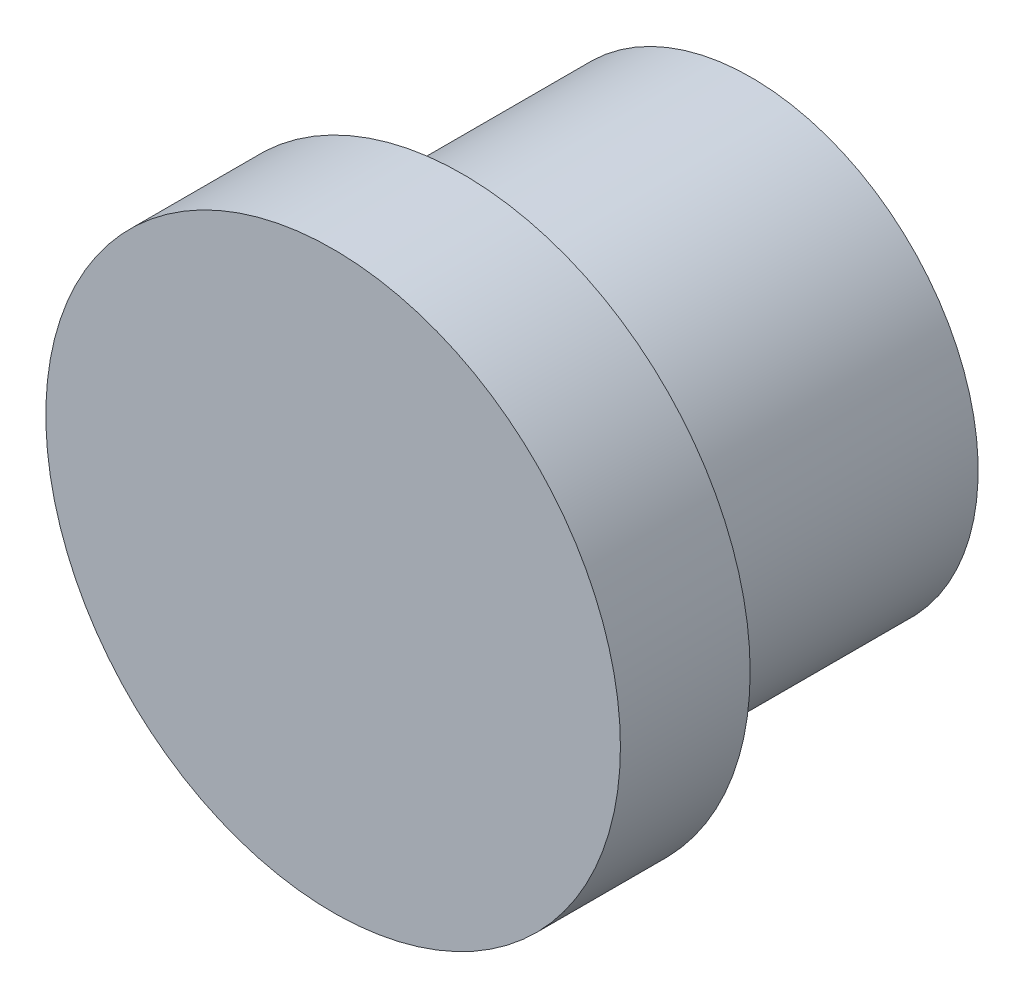
ISO-10303-21;
HEADER;
FILE_DESCRIPTION(('STEP AP214'),'2;1');
FILE_NAME('part.step','',(''),(''),'','','');
FILE_SCHEMA(('AUTOMOTIVE_DESIGN { 1 0 10303 214 1 1 1 1 }'));
ENDSEC;
DATA;
#1=APPLICATION_CONTEXT('core data for automotive mechanical design processes');
#2=APPLICATION_PROTOCOL_DEFINITION('international standard','automotive_design',2000,#1);
#3=PRODUCT_CONTEXT('',#1,'mechanical');
#4=PRODUCT('Part','Part','',(#3));
#5=PRODUCT_RELATED_PRODUCT_CATEGORY('part','',(#4));
#6=PRODUCT_DEFINITION_FORMATION('','',#4);
#7=PRODUCT_DEFINITION_CONTEXT('part definition',#1,'design');
#8=PRODUCT_DEFINITION('design','',#6,#7);
#9=PRODUCT_DEFINITION_SHAPE('','',#8);
#10=(LENGTH_UNIT() NAMED_UNIT(*) SI_UNIT(.MILLI.,.METRE.));
#11=(NAMED_UNIT(*) PLANE_ANGLE_UNIT() SI_UNIT($,.RADIAN.));
#12=(NAMED_UNIT(*) SI_UNIT($,.STERADIAN.) SOLID_ANGLE_UNIT());
#13=UNCERTAINTY_MEASURE_WITH_UNIT(LENGTH_MEASURE(1.E-05),#10,'distance_accuracy_value','');
#14=(GEOMETRIC_REPRESENTATION_CONTEXT(3) GLOBAL_UNCERTAINTY_ASSIGNED_CONTEXT((#13)) GLOBAL_UNIT_ASSIGNED_CONTEXT((#10,
#11,#12)) REPRESENTATION_CONTEXT('',''));
#15=CARTESIAN_POINT('',(0.,0.,0.));
#16=DIRECTION('',(0.,0.,1.));
#17=DIRECTION('',(1.,0.,0.));
#18=AXIS2_PLACEMENT_3D('',#15,#16,#17);
#19=CARTESIAN_POINT('',(0.,0.,4.064));
#20=DIRECTION('',(0.,0.,-1.));
#21=DIRECTION('',(-1.,0.,0.));
#22=AXIS2_PLACEMENT_3D('',#19,#20,#21);
#23=CYLINDRICAL_SURFACE('',#22,9.);
#24=CARTESIAN_POINT('',(0.,0.,4.064));
#25=DIRECTION('',(0.,0.,1.));
#26=DIRECTION('',(1.,0.,0.));
#27=AXIS2_PLACEMENT_3D('',#24,#25,#26);
#28=CIRCLE('',#27,9.);
#29=CARTESIAN_POINT('',(9.,0.,4.064));
#30=VERTEX_POINT('',#29);
#31=EDGE_CURVE('E38',#30,#30,#28,.T.);
#32=ORIENTED_EDGE('',*,*,#31,.F.);
#33=EDGE_LOOP('',(#32));
#34=FACE_BOUND('',#33,.T.);
#35=CARTESIAN_POINT('',(0.,0.,0.));
#36=DIRECTION('',(0.,0.,1.));
#37=DIRECTION('',(1.,0.,0.));
#38=AXIS2_PLACEMENT_3D('',#35,#36,#37);
#39=CIRCLE('',#38,9.);
#40=CARTESIAN_POINT('',(9.,0.,0.));
#41=VERTEX_POINT('',#40);
#42=EDGE_CURVE('E34',#41,#41,#39,.T.);
#43=ORIENTED_EDGE('',*,*,#42,.T.);
#44=EDGE_LOOP('',(#43));
#45=FACE_BOUND('',#44,.T.);
#46=ADVANCED_FACE('F31',(#34,#45),#23,.T.);
#47=CARTESIAN_POINT('',(0.,0.,4.064));
#48=DIRECTION('',(0.,0.,1.));
#49=DIRECTION('',(1.,0.,0.));
#50=AXIS2_PLACEMENT_3D('',#47,#48,#49);
#51=PLANE('',#50);
#52=ORIENTED_EDGE('',*,*,#31,.T.);
#53=EDGE_LOOP('',(#52));
#54=FACE_BOUND('',#53,.T.);
#55=ADVANCED_FACE('F55',(#54),#51,.T.);
#56=CARTESIAN_POINT('',(0.,0.,0.));
#57=DIRECTION('',(0.,0.,1.));
#58=DIRECTION('',(1.,0.,0.));
#59=AXIS2_PLACEMENT_3D('',#56,#57,#58);
#60=PLANE('',#59);
#61=CARTESIAN_POINT('',(0.,0.,0.));
#62=DIRECTION('',(0.,0.,-1.));
#63=DIRECTION('',(-1.,0.,0.));
#64=AXIS2_PLACEMENT_3D('',#61,#62,#63);
#65=CIRCLE('',#64,7.11);
#66=CARTESIAN_POINT('',(-7.11,0.,0.));
#67=VERTEX_POINT('',#66);
#68=EDGE_CURVE('E10',#67,#67,#65,.T.);
#69=ORIENTED_EDGE('',*,*,#68,.F.);
#70=EDGE_LOOP('',(#69));
#71=FACE_BOUND('',#70,.T.);
#72=ORIENTED_EDGE('',*,*,#42,.F.);
#73=EDGE_LOOP('',(#72));
#74=FACE_BOUND('',#73,.T.);
#75=ADVANCED_FACE('F52',(#71,#74),#60,.F.);
#76=CARTESIAN_POINT('',(0.,0.,-9.03294143458267));
#77=DIRECTION('',(0.,0.,1.));
#78=DIRECTION('',(1.,0.,0.));
#79=AXIS2_PLACEMENT_3D('',#76,#77,#78);
#80=CYLINDRICAL_SURFACE('',#79,7.11);
#81=CARTESIAN_POINT('',(0.,0.,-9.03294143458267));
#82=DIRECTION('',(0.,0.,-1.));
#83=DIRECTION('',(-1.,0.,0.));
#84=AXIS2_PLACEMENT_3D('',#81,#82,#83);
#85=CIRCLE('',#84,7.11);
#86=CARTESIAN_POINT('',(-7.11,0.,-9.03294143458267));
#87=VERTEX_POINT('',#86);
#88=EDGE_CURVE('E44',#87,#87,#85,.T.);
#89=ORIENTED_EDGE('',*,*,#88,.F.);
#90=EDGE_LOOP('',(#89));
#91=FACE_BOUND('',#90,.T.);
#92=ORIENTED_EDGE('',*,*,#68,.T.);
#93=EDGE_LOOP('',(#92));
#94=FACE_BOUND('',#93,.T.);
#95=ADVANCED_FACE('F54',(#91,#94),#80,.T.);
#96=CARTESIAN_POINT('',(0.,0.,-9.03294143458267));
#97=DIRECTION('',(0.,0.,-1.));
#98=DIRECTION('',(-1.,0.,0.));
#99=AXIS2_PLACEMENT_3D('',#96,#97,#98);
#100=PLANE('',#99);
#101=ORIENTED_EDGE('',*,*,#88,.T.);
#102=EDGE_LOOP('',(#101));
#103=FACE_BOUND('',#102,.T.);
#104=ADVANCED_FACE('F61',(#103),#100,.T.);
#105=CLOSED_SHELL('',(#46,#55,#75,#95,#104));
#106=MANIFOLD_SOLID_BREP('B2',#105);
#107=ADVANCED_BREP_SHAPE_REPRESENTATION('',(#18,#106),#14);
#108=SHAPE_DEFINITION_REPRESENTATION(#9,#107);
ENDSEC;
END-ISO-10303-21;
